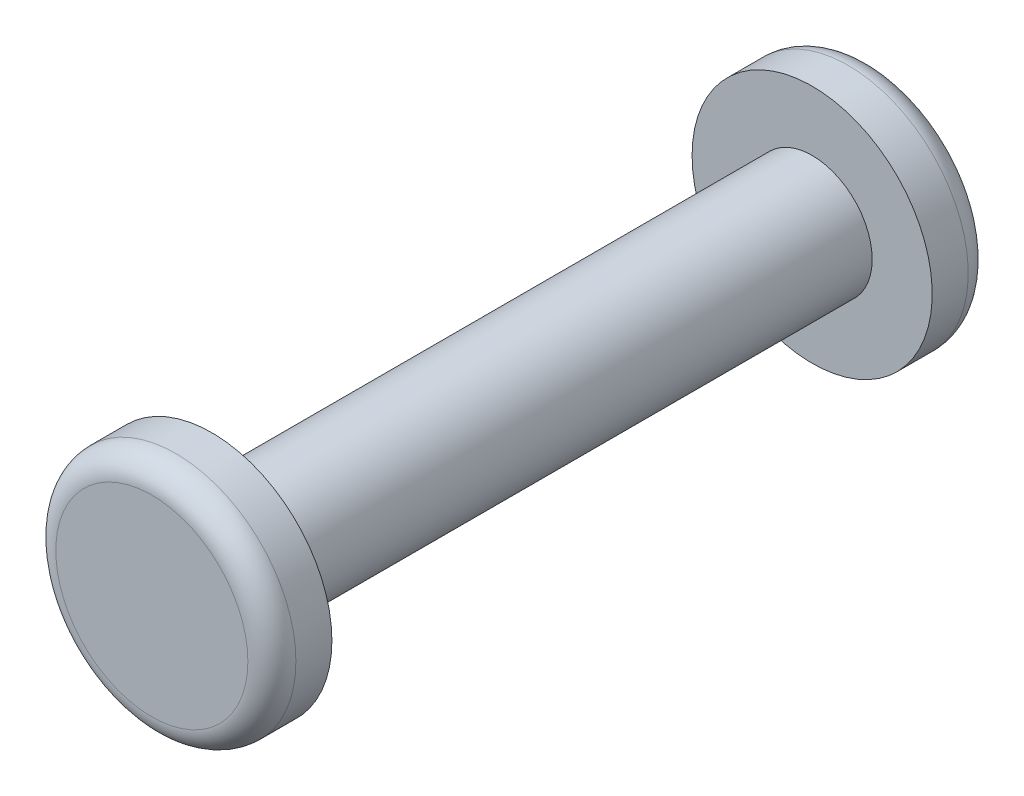
ISO-10303-21;
HEADER;
FILE_DESCRIPTION(('STEP AP214'),'2;1');
FILE_NAME('part.step','',(''),(''),'','','');
FILE_SCHEMA(('AUTOMOTIVE_DESIGN { 1 0 10303 214 1 1 1 1 }'));
ENDSEC;
DATA;
#1=APPLICATION_CONTEXT('core data for automotive mechanical design processes');
#2=APPLICATION_PROTOCOL_DEFINITION('international standard','automotive_design',2000,#1);
#3=PRODUCT_CONTEXT('',#1,'mechanical');
#4=PRODUCT('Part','Part','',(#3));
#5=PRODUCT_RELATED_PRODUCT_CATEGORY('part','',(#4));
#6=PRODUCT_DEFINITION_FORMATION('','',#4);
#7=PRODUCT_DEFINITION_CONTEXT('part definition',#1,'design');
#8=PRODUCT_DEFINITION('design','',#6,#7);
#9=PRODUCT_DEFINITION_SHAPE('','',#8);
#10=(LENGTH_UNIT() NAMED_UNIT(*) SI_UNIT(.MILLI.,.METRE.));
#11=(NAMED_UNIT(*) PLANE_ANGLE_UNIT() SI_UNIT($,.RADIAN.));
#12=(NAMED_UNIT(*) SI_UNIT($,.STERADIAN.) SOLID_ANGLE_UNIT());
#13=UNCERTAINTY_MEASURE_WITH_UNIT(LENGTH_MEASURE(1.E-05),#10,'distance_accuracy_value','');
#14=(GEOMETRIC_REPRESENTATION_CONTEXT(3) GLOBAL_UNCERTAINTY_ASSIGNED_CONTEXT((#13)) GLOBAL_UNIT_ASSIGNED_CONTEXT((#10,
#11,#12)) REPRESENTATION_CONTEXT('',''));
#15=CARTESIAN_POINT('',(0.,0.,0.));
#16=DIRECTION('',(0.,0.,1.));
#17=DIRECTION('',(1.,0.,0.));
#18=AXIS2_PLACEMENT_3D('',#15,#16,#17);
#19=CARTESIAN_POINT('',(0.,0.,25.));
#20=DIRECTION('',(0.,0.,-1.));
#21=DIRECTION('',(-1.,0.,0.));
#22=AXIS2_PLACEMENT_3D('',#19,#20,#21);
#23=CYLINDRICAL_SURFACE('',#22,5.);
#24=CARTESIAN_POINT('',(0.,0.,25.));
#25=DIRECTION('',(0.,0.,1.));
#26=DIRECTION('',(1.,0.,0.));
#27=AXIS2_PLACEMENT_3D('',#24,#25,#26);
#28=CIRCLE('',#27,5.);
#29=CARTESIAN_POINT('',(5.,0.,25.));
#30=VERTEX_POINT('',#29);
#31=EDGE_CURVE('E61',#30,#30,#28,.T.);
#32=ORIENTED_EDGE('',*,*,#31,.F.);
#33=EDGE_LOOP('',(#32));
#34=FACE_BOUND('',#33,.T.);
#35=CARTESIAN_POINT('',(0.,0.,-25.));
#36=DIRECTION('',(0.,0.,1.));
#37=DIRECTION('',(1.,0.,0.));
#38=AXIS2_PLACEMENT_3D('',#35,#36,#37);
#39=CIRCLE('',#38,5.);
#40=CARTESIAN_POINT('',(5.,0.,-25.));
#41=VERTEX_POINT('',#40);
#42=EDGE_CURVE('E62',#41,#41,#39,.T.);
#43=ORIENTED_EDGE('',*,*,#42,.T.);
#44=EDGE_LOOP('',(#43));
#45=FACE_BOUND('',#44,.T.);
#46=ADVANCED_FACE('F37',(#34,#45),#23,.T.);
#47=CARTESIAN_POINT('',(0.,0.,30.));
#48=DIRECTION('',(0.,0.,-1.));
#49=DIRECTION('',(-1.,0.,0.));
#50=AXIS2_PLACEMENT_3D('',#47,#48,#49);
#51=CYLINDRICAL_SURFACE('',#50,10.);
#52=CARTESIAN_POINT('',(0.,0.,28.));
#53=DIRECTION('',(0.,0.,1.));
#54=DIRECTION('',(1.,0.,0.));
#55=AXIS2_PLACEMENT_3D('',#52,#53,#54);
#56=CIRCLE('',#55,10.);
#57=CARTESIAN_POINT('',(10.,0.,28.));
#58=VERTEX_POINT('',#57);
#59=EDGE_CURVE('E50',#58,#58,#56,.F.);
#60=ORIENTED_EDGE('',*,*,#59,.T.);
#61=EDGE_LOOP('',(#60));
#62=FACE_BOUND('',#61,.T.);
#63=CARTESIAN_POINT('',(0.,0.,25.));
#64=DIRECTION('',(0.,0.,1.));
#65=DIRECTION('',(1.,0.,0.));
#66=AXIS2_PLACEMENT_3D('',#63,#64,#65);
#67=CIRCLE('',#66,10.);
#68=CARTESIAN_POINT('',(10.,0.,25.));
#69=VERTEX_POINT('',#68);
#70=EDGE_CURVE('E66',#69,#69,#67,.T.);
#71=ORIENTED_EDGE('',*,*,#70,.T.);
#72=EDGE_LOOP('',(#71));
#73=FACE_BOUND('',#72,.T.);
#74=ADVANCED_FACE('F95',(#62,#73),#51,.T.);
#75=CARTESIAN_POINT('',(0.,0.,30.));
#76=DIRECTION('',(0.,0.,1.));
#77=DIRECTION('',(1.,0.,0.));
#78=AXIS2_PLACEMENT_3D('',#75,#76,#77);
#79=PLANE('',#78);
#80=CARTESIAN_POINT('',(0.,0.,30.));
#81=DIRECTION('',(0.,0.,1.));
#82=DIRECTION('',(1.,0.,0.));
#83=AXIS2_PLACEMENT_3D('',#80,#81,#82);
#84=CIRCLE('',#83,8.);
#85=CARTESIAN_POINT('',(8.,0.,30.));
#86=VERTEX_POINT('',#85);
#87=EDGE_CURVE('E55',#86,#86,#84,.T.);
#88=ORIENTED_EDGE('',*,*,#87,.T.);
#89=EDGE_LOOP('',(#88));
#90=FACE_BOUND('',#89,.T.);
#91=ADVANCED_FACE('F101',(#90),#79,.T.);
#92=CARTESIAN_POINT('',(0.,0.,25.));
#93=DIRECTION('',(0.,0.,1.));
#94=DIRECTION('',(1.,0.,0.));
#95=AXIS2_PLACEMENT_3D('',#92,#93,#94);
#96=PLANE('',#95);
#97=ORIENTED_EDGE('',*,*,#31,.T.);
#98=EDGE_LOOP('',(#97));
#99=FACE_BOUND('',#98,.T.);
#100=ORIENTED_EDGE('',*,*,#70,.F.);
#101=EDGE_LOOP('',(#100));
#102=FACE_BOUND('',#101,.T.);
#103=ADVANCED_FACE('F107',(#99,#102),#96,.F.);
#104=CARTESIAN_POINT('',(0.,0.,-30.));
#105=DIRECTION('',(0.,0.,1.));
#106=DIRECTION('',(1.,0.,0.));
#107=AXIS2_PLACEMENT_3D('',#104,#105,#106);
#108=CYLINDRICAL_SURFACE('',#107,10.);
#109=CARTESIAN_POINT('',(0.,0.,-28.));
#110=DIRECTION('',(0.,0.,-1.));
#111=DIRECTION('',(-1.,0.,0.));
#112=AXIS2_PLACEMENT_3D('',#109,#110,#111);
#113=CIRCLE('',#112,10.);
#114=CARTESIAN_POINT('',(-10.,0.,-28.));
#115=VERTEX_POINT('',#114);
#116=EDGE_CURVE('E10',#115,#115,#113,.F.);
#117=ORIENTED_EDGE('',*,*,#116,.T.);
#118=EDGE_LOOP('',(#117));
#119=FACE_BOUND('',#118,.T.);
#120=CARTESIAN_POINT('',(0.,0.,-25.));
#121=DIRECTION('',(0.,0.,-1.));
#122=DIRECTION('',(-1.,0.,0.));
#123=AXIS2_PLACEMENT_3D('',#120,#121,#122);
#124=CIRCLE('',#123,10.);
#125=CARTESIAN_POINT('',(-10.,0.,-25.));
#126=VERTEX_POINT('',#125);
#127=EDGE_CURVE('E67',#126,#126,#124,.T.);
#128=ORIENTED_EDGE('',*,*,#127,.T.);
#129=EDGE_LOOP('',(#128));
#130=FACE_BOUND('',#129,.T.);
#131=ADVANCED_FACE('F78',(#119,#130),#108,.T.);
#132=CARTESIAN_POINT('',(0.,0.,-30.));
#133=DIRECTION('',(0.,0.,-1.));
#134=DIRECTION('',(-1.,0.,0.));
#135=AXIS2_PLACEMENT_3D('',#132,#133,#134);
#136=PLANE('',#135);
#137=CARTESIAN_POINT('',(0.,0.,-30.));
#138=DIRECTION('',(0.,0.,-1.));
#139=DIRECTION('',(-1.,0.,0.));
#140=AXIS2_PLACEMENT_3D('',#137,#138,#139);
#141=CIRCLE('',#140,8.);
#142=CARTESIAN_POINT('',(-8.,0.,-30.));
#143=VERTEX_POINT('',#142);
#144=EDGE_CURVE('E45',#143,#143,#141,.T.);
#145=ORIENTED_EDGE('',*,*,#144,.T.);
#146=EDGE_LOOP('',(#145));
#147=FACE_BOUND('',#146,.T.);
#148=ADVANCED_FACE('F83',(#147),#136,.T.);
#149=CARTESIAN_POINT('',(0.,0.,-25.));
#150=DIRECTION('',(0.,0.,-1.));
#151=DIRECTION('',(-1.,0.,0.));
#152=AXIS2_PLACEMENT_3D('',#149,#150,#151);
#153=PLANE('',#152);
#154=ORIENTED_EDGE('',*,*,#42,.F.);
#155=EDGE_LOOP('',(#154));
#156=FACE_BOUND('',#155,.T.);
#157=ORIENTED_EDGE('',*,*,#127,.F.);
#158=EDGE_LOOP('',(#157));
#159=FACE_BOUND('',#158,.T.);
#160=ADVANCED_FACE('F80',(#156,#159),#153,.F.);
#161=CARTESIAN_POINT('',(0.,0.,28.));
#162=DIRECTION('',(0.,0.,1.));
#163=DIRECTION('',(1.,0.,0.));
#164=AXIS2_PLACEMENT_3D('',#161,#162,#163);
#165=TOROIDAL_SURFACE('',#164,8.,2.);
#166=ORIENTED_EDGE('',*,*,#59,.F.);
#167=EDGE_LOOP('',(#166));
#168=FACE_BOUND('',#167,.T.);
#169=ORIENTED_EDGE('',*,*,#87,.F.);
#170=EDGE_LOOP('',(#169));
#171=FACE_BOUND('',#170,.T.);
#172=ADVANCED_FACE('F82',(#168,#171),#165,.T.);
#173=CARTESIAN_POINT('',(0.,0.,-28.));
#174=DIRECTION('',(0.,0.,-1.));
#175=DIRECTION('',(-1.,0.,0.));
#176=AXIS2_PLACEMENT_3D('',#173,#174,#175);
#177=TOROIDAL_SURFACE('',#176,8.,2.);
#178=ORIENTED_EDGE('',*,*,#116,.F.);
#179=EDGE_LOOP('',(#178));
#180=FACE_BOUND('',#179,.T.);
#181=ORIENTED_EDGE('',*,*,#144,.F.);
#182=EDGE_LOOP('',(#181));
#183=FACE_BOUND('',#182,.T.);
#184=ADVANCED_FACE('F39',(#180,#183),#177,.T.);
#185=CLOSED_SHELL('',(#46,#74,#91,#103,#131,#148,#160,#172,#184));
#186=MANIFOLD_SOLID_BREP('B2',#185);
#187=ADVANCED_BREP_SHAPE_REPRESENTATION('',(#18,#186),#14);
#188=SHAPE_DEFINITION_REPRESENTATION(#9,#187);
ENDSEC;
END-ISO-10303-21;
